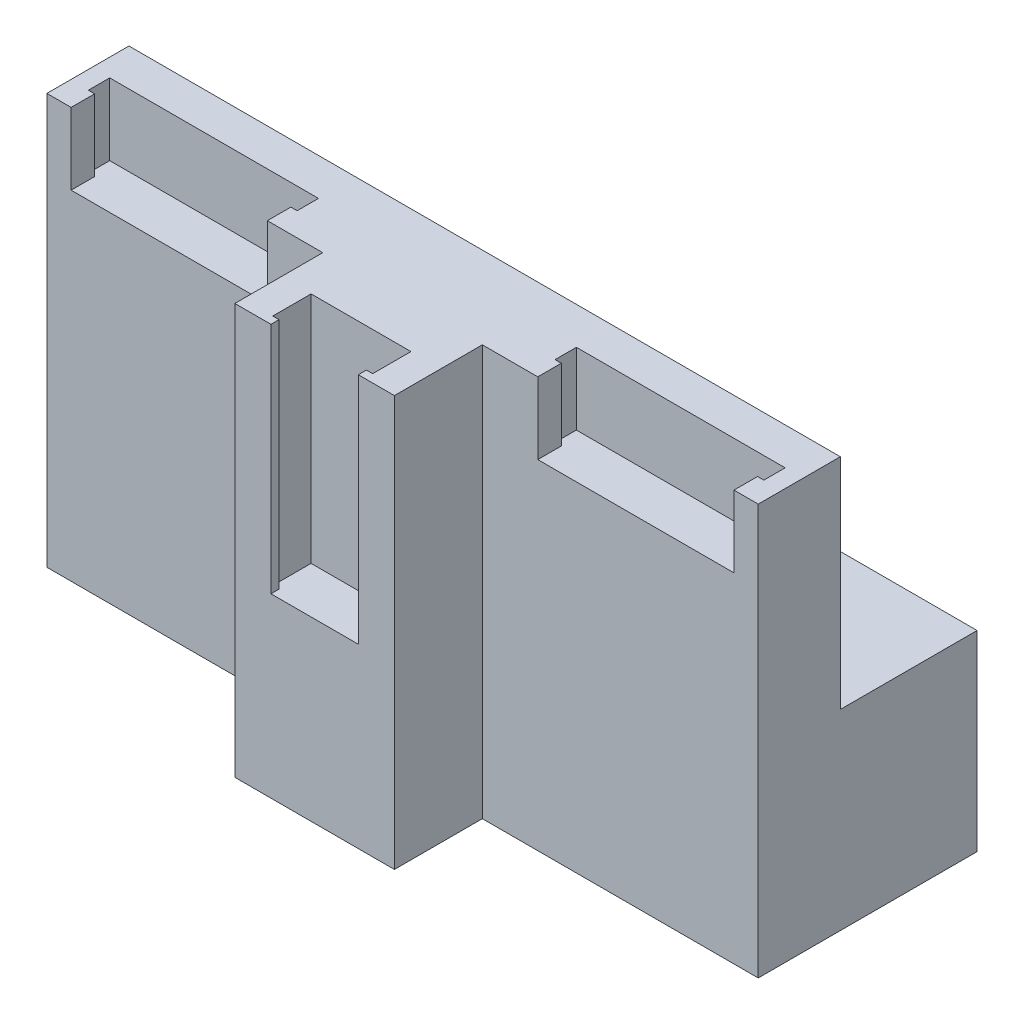
ISO-10303-21;
HEADER;
FILE_DESCRIPTION(('STEP AP214'),'2;1');
FILE_NAME('part.step','',(''),(''),'','','');
FILE_SCHEMA(('AUTOMOTIVE_DESIGN { 1 0 10303 214 1 1 1 1 }'));
ENDSEC;
DATA;
#1=APPLICATION_CONTEXT('core data for automotive mechanical design processes');
#2=APPLICATION_PROTOCOL_DEFINITION('international standard','automotive_design',2000,#1);
#3=PRODUCT_CONTEXT('',#1,'mechanical');
#4=PRODUCT('Part','Part','',(#3));
#5=PRODUCT_RELATED_PRODUCT_CATEGORY('part','',(#4));
#6=PRODUCT_DEFINITION_FORMATION('','',#4);
#7=PRODUCT_DEFINITION_CONTEXT('part definition',#1,'design');
#8=PRODUCT_DEFINITION('design','',#6,#7);
#9=PRODUCT_DEFINITION_SHAPE('','',#8);
#10=(LENGTH_UNIT() NAMED_UNIT(*) SI_UNIT(.MILLI.,.METRE.));
#11=(NAMED_UNIT(*) PLANE_ANGLE_UNIT() SI_UNIT($,.RADIAN.));
#12=(NAMED_UNIT(*) SI_UNIT($,.STERADIAN.) SOLID_ANGLE_UNIT());
#13=UNCERTAINTY_MEASURE_WITH_UNIT(LENGTH_MEASURE(1.E-05),#10,'distance_accuracy_value','');
#14=(GEOMETRIC_REPRESENTATION_CONTEXT(3) GLOBAL_UNCERTAINTY_ASSIGNED_CONTEXT((#13)) GLOBAL_UNIT_ASSIGNED_CONTEXT((#10,
#11,#12)) REPRESENTATION_CONTEXT('',''));
#15=CARTESIAN_POINT('',(0.,0.,0.));
#16=DIRECTION('',(0.,0.,1.));
#17=DIRECTION('',(1.,0.,0.));
#18=AXIS2_PLACEMENT_3D('',#15,#16,#17);
#19=CARTESIAN_POINT('',(60.5700000000001,0.,11.8));
#20=DIRECTION('',(-1.,0.,0.));
#21=DIRECTION('',(0.,0.,1.));
#22=AXIS2_PLACEMENT_3D('',#19,#20,#21);
#23=PLANE('',#22);
#24=DIRECTION('',(0.,1.,0.));
#25=VECTOR('',#24,1.);
#26=CARTESIAN_POINT('',(60.5700000000001,75.,15.7));
#27=LINE('',#26,#25);
#28=CARTESIAN_POINT('',(60.5700000000001,61.9,15.7));
#29=VERTEX_POINT('',#28);
#30=CARTESIAN_POINT('',(60.5700000000001,75.,15.7));
#31=VERTEX_POINT('',#30);
#32=EDGE_CURVE('E270',#29,#31,#27,.T.);
#33=ORIENTED_EDGE('',*,*,#32,.F.);
#34=DIRECTION('',(0.,0.,-1.));
#35=VECTOR('',#34,1.);
#36=CARTESIAN_POINT('',(60.5700000000001,61.9,15.7));
#37=LINE('',#36,#35);
#38=CARTESIAN_POINT('',(60.5700000000001,61.9,20.));
#39=VERTEX_POINT('',#38);
#40=EDGE_CURVE('E256',#39,#29,#37,.T.);
#41=ORIENTED_EDGE('',*,*,#40,.F.);
#42=DIRECTION('',(0.,-1.,0.));
#43=VECTOR('',#42,1.);
#44=CARTESIAN_POINT('',(60.5700000000001,0.,20.));
#45=LINE('',#44,#43);
#46=CARTESIAN_POINT('',(60.5700000000001,75.,20.));
#47=VERTEX_POINT('',#46);
#48=EDGE_CURVE('E268',#47,#39,#45,.T.);
#49=ORIENTED_EDGE('',*,*,#48,.F.);
#50=DIRECTION('',(0.,0.,1.));
#51=VECTOR('',#50,1.);
#52=CARTESIAN_POINT('',(60.5700000000001,75.,11.8));
#53=LINE('',#52,#51);
#54=EDGE_CURVE('E287',#31,#47,#53,.T.);
#55=ORIENTED_EDGE('',*,*,#54,.F.);
#56=EDGE_LOOP('',(#33,#41,#49,#55));
#57=FACE_BOUND('',#56,.T.);
#58=ADVANCED_FACE('F32',(#57),#23,.T.);
#59=CARTESIAN_POINT('',(24.7100000000001,0.,11.8));
#60=DIRECTION('',(-1.,0.,0.));
#61=DIRECTION('',(0.,-1.,0.));
#62=AXIS2_PLACEMENT_3D('',#59,#60,#61);
#63=PLANE('',#62);
#64=DIRECTION('',(0.,0.,1.));
#65=VECTOR('',#64,1.);
#66=CARTESIAN_POINT('',(24.7100000000001,61.9,20.));
#67=LINE('',#66,#65);
#68=CARTESIAN_POINT('',(24.7100000000001,61.9,15.7));
#69=VERTEX_POINT('',#68);
#70=CARTESIAN_POINT('',(24.7100000000001,61.9,20.));
#71=VERTEX_POINT('',#70);
#72=EDGE_CURVE('E258',#69,#71,#67,.T.);
#73=ORIENTED_EDGE('',*,*,#72,.F.);
#74=DIRECTION('',(0.,-1.,0.));
#75=VECTOR('',#74,1.);
#76=CARTESIAN_POINT('',(24.7100000000001,75.,15.7));
#77=LINE('',#76,#75);
#78=CARTESIAN_POINT('',(24.7100000000001,75.,15.7));
#79=VERTEX_POINT('',#78);
#80=EDGE_CURVE('E505',#79,#69,#77,.T.);
#81=ORIENTED_EDGE('',*,*,#80,.F.);
#82=DIRECTION('',(0.,0.,1.));
#83=VECTOR('',#82,1.);
#84=CARTESIAN_POINT('',(24.7100000000001,75.,11.8));
#85=LINE('',#84,#83);
#86=CARTESIAN_POINT('',(24.7100000000001,75.,20.));
#87=VERTEX_POINT('',#86);
#88=EDGE_CURVE('E284',#79,#87,#85,.T.);
#89=ORIENTED_EDGE('',*,*,#88,.T.);
#90=DIRECTION('',(0.,-1.,0.));
#91=VECTOR('',#90,1.);
#92=CARTESIAN_POINT('',(24.7100000000001,0.,20.));
#93=LINE('',#92,#91);
#94=EDGE_CURVE('E275',#87,#71,#93,.T.);
#95=ORIENTED_EDGE('',*,*,#94,.T.);
#96=EDGE_LOOP('',(#73,#81,#89,#95));
#97=FACE_BOUND('',#96,.T.);
#98=ADVANCED_FACE('F522',(#97),#63,.F.);
#99=CARTESIAN_POINT('',(0.,0.,11.8));
#100=DIRECTION('',(0.,0.,1.));
#101=DIRECTION('',(1.,0.,0.));
#102=AXIS2_PLACEMENT_3D('',#99,#100,#101);
#103=PLANE('',#102);
#104=DIRECTION('',(0.,1.,0.));
#105=VECTOR('',#104,1.);
#106=CARTESIAN_POINT('',(23.5650000000001,75.,11.8));
#107=LINE('',#106,#105);
#108=CARTESIAN_POINT('',(23.5650000000001,61.9,11.8));
#109=VERTEX_POINT('',#108);
#110=CARTESIAN_POINT('',(23.5650000000001,75.,11.8));
#111=VERTEX_POINT('',#110);
#112=EDGE_CURVE('E506',#109,#111,#107,.T.);
#113=ORIENTED_EDGE('',*,*,#112,.F.);
#114=DIRECTION('',(-1.,0.,0.));
#115=VECTOR('',#114,1.);
#116=CARTESIAN_POINT('',(23.5650000000001,61.9,11.8));
#117=LINE('',#116,#115);
#118=CARTESIAN_POINT('',(61.7150000000001,61.9,11.8));
#119=VERTEX_POINT('',#118);
#120=EDGE_CURVE('E988',#119,#109,#117,.T.);
#121=ORIENTED_EDGE('',*,*,#120,.F.);
#122=DIRECTION('',(0.,-1.,0.));
#123=VECTOR('',#122,1.);
#124=CARTESIAN_POINT('',(61.7150000000001,75.,11.8));
#125=LINE('',#124,#123);
#126=CARTESIAN_POINT('',(61.7150000000001,75.,11.8));
#127=VERTEX_POINT('',#126);
#128=EDGE_CURVE('E493',#127,#119,#125,.T.);
#129=ORIENTED_EDGE('',*,*,#128,.F.);
#130=DIRECTION('',(-1.,0.,0.));
#131=VECTOR('',#130,1.);
#132=CARTESIAN_POINT('',(0.,75.,11.8));
#133=LINE('',#132,#131);
#134=EDGE_CURVE('E278',#127,#111,#133,.T.);
#135=ORIENTED_EDGE('',*,*,#134,.T.);
#136=EDGE_LOOP('',(#113,#121,#129,#135));
#137=FACE_BOUND('',#136,.T.);
#138=ADVANCED_FACE('F592',(#137),#103,.T.);
#139=CARTESIAN_POINT('',(23.5650000000001,75.,15.7));
#140=DIRECTION('',(0.,0.,1.));
#141=DIRECTION('',(0.,-1.,0.));
#142=AXIS2_PLACEMENT_3D('',#139,#140,#141);
#143=PLANE('',#142);
#144=DIRECTION('',(1.,0.,0.));
#145=VECTOR('',#144,1.);
#146=CARTESIAN_POINT('',(24.7100000000001,61.9,15.7));
#147=LINE('',#146,#145);
#148=CARTESIAN_POINT('',(23.5650000000001,61.9,15.7));
#149=VERTEX_POINT('',#148);
#150=EDGE_CURVE('E518',#149,#69,#147,.T.);
#151=ORIENTED_EDGE('',*,*,#150,.F.);
#152=DIRECTION('',(0.,-1.,0.));
#153=VECTOR('',#152,1.);
#154=CARTESIAN_POINT('',(23.5650000000001,75.,15.7));
#155=LINE('',#154,#153);
#156=CARTESIAN_POINT('',(23.5650000000001,75.,15.7));
#157=VERTEX_POINT('',#156);
#158=EDGE_CURVE('E280',#157,#149,#155,.T.);
#159=ORIENTED_EDGE('',*,*,#158,.F.);
#160=DIRECTION('',(1.,0.,0.));
#161=VECTOR('',#160,1.);
#162=CARTESIAN_POINT('',(23.5650000000001,75.,15.7));
#163=LINE('',#162,#161);
#164=EDGE_CURVE('E276',#157,#79,#163,.T.);
#165=ORIENTED_EDGE('',*,*,#164,.T.);
#166=ORIENTED_EDGE('',*,*,#80,.T.);
#167=EDGE_LOOP('',(#151,#159,#165,#166));
#168=FACE_BOUND('',#167,.T.);
#169=ADVANCED_FACE('F517',(#168),#143,.F.);
#170=CARTESIAN_POINT('',(23.5650000000001,0.,0.));
#171=DIRECTION('',(-1.,0.,0.));
#172=DIRECTION('',(0.,-1.,0.));
#173=AXIS2_PLACEMENT_3D('',#170,#171,#172);
#174=PLANE('',#173);
#175=DIRECTION('',(0.,0.,1.));
#176=VECTOR('',#175,1.);
#177=CARTESIAN_POINT('',(23.5650000000001,61.9,15.7));
#178=LINE('',#177,#176);
#179=EDGE_CURVE('E986',#109,#149,#178,.T.);
#180=ORIENTED_EDGE('',*,*,#179,.F.);
#181=ORIENTED_EDGE('',*,*,#112,.T.);
#182=DIRECTION('',(0.,0.,1.));
#183=VECTOR('',#182,1.);
#184=CARTESIAN_POINT('',(23.5650000000001,75.,11.8));
#185=LINE('',#184,#183);
#186=EDGE_CURVE('E508',#111,#157,#185,.T.);
#187=ORIENTED_EDGE('',*,*,#186,.T.);
#188=ORIENTED_EDGE('',*,*,#158,.T.);
#189=EDGE_LOOP('',(#180,#181,#187,#188));
#190=FACE_BOUND('',#189,.T.);
#191=ADVANCED_FACE('F600',(#190),#174,.F.);
#192=CARTESIAN_POINT('',(61.7150000000001,75.,15.7));
#193=DIRECTION('',(0.,0.,1.));
#194=DIRECTION('',(0.,-1.,0.));
#195=AXIS2_PLACEMENT_3D('',#192,#193,#194);
#196=PLANE('',#195);
#197=DIRECTION('',(1.,0.,0.));
#198=VECTOR('',#197,1.);
#199=CARTESIAN_POINT('',(61.7150000000001,61.9,15.7));
#200=LINE('',#199,#198);
#201=CARTESIAN_POINT('',(61.7150000000001,61.9,15.7));
#202=VERTEX_POINT('',#201);
#203=EDGE_CURVE('E50',#29,#202,#200,.T.);
#204=ORIENTED_EDGE('',*,*,#203,.F.);
#205=ORIENTED_EDGE('',*,*,#32,.T.);
#206=DIRECTION('',(-1.,0.,0.));
#207=VECTOR('',#206,1.);
#208=CARTESIAN_POINT('',(61.7150000000001,75.,15.7));
#209=LINE('',#208,#207);
#210=CARTESIAN_POINT('',(61.7150000000001,75.,15.7));
#211=VERTEX_POINT('',#210);
#212=EDGE_CURVE('E501',#211,#31,#209,.T.);
#213=ORIENTED_EDGE('',*,*,#212,.F.);
#214=DIRECTION('',(0.,1.,0.));
#215=VECTOR('',#214,1.);
#216=CARTESIAN_POINT('',(61.7150000000001,75.,15.7));
#217=LINE('',#216,#215);
#218=EDGE_CURVE('E496',#202,#211,#217,.T.);
#219=ORIENTED_EDGE('',*,*,#218,.F.);
#220=EDGE_LOOP('',(#204,#205,#213,#219));
#221=FACE_BOUND('',#220,.T.);
#222=ADVANCED_FACE('F603',(#221),#196,.F.);
#223=CARTESIAN_POINT('',(61.7150000000001,0.,0.));
#224=DIRECTION('',(-1.,0.,0.));
#225=DIRECTION('',(0.,0.,1.));
#226=AXIS2_PLACEMENT_3D('',#223,#224,#225);
#227=PLANE('',#226);
#228=ORIENTED_EDGE('',*,*,#128,.T.);
#229=DIRECTION('',(0.,0.,-1.));
#230=VECTOR('',#229,1.);
#231=CARTESIAN_POINT('',(61.7150000000001,61.9,11.8));
#232=LINE('',#231,#230);
#233=EDGE_CURVE('E990',#202,#119,#232,.T.);
#234=ORIENTED_EDGE('',*,*,#233,.F.);
#235=ORIENTED_EDGE('',*,*,#218,.T.);
#236=DIRECTION('',(0.,0.,-1.));
#237=VECTOR('',#236,1.);
#238=CARTESIAN_POINT('',(61.7150000000001,75.,11.8));
#239=LINE('',#238,#237);
#240=EDGE_CURVE('E498',#211,#127,#239,.T.);
#241=ORIENTED_EDGE('',*,*,#240,.T.);
#242=EDGE_LOOP('',(#228,#234,#235,#241));
#243=FACE_BOUND('',#242,.T.);
#244=ADVANCED_FACE('F607',(#243),#227,.T.);
#245=CARTESIAN_POINT('',(-60.57,0.,11.8));
#246=DIRECTION('',(-1.,0.,0.));
#247=DIRECTION('',(0.,0.,1.));
#248=AXIS2_PLACEMENT_3D('',#245,#246,#247);
#249=PLANE('',#248);
#250=DIRECTION('',(0.,0.,1.));
#251=VECTOR('',#250,1.);
#252=CARTESIAN_POINT('',(-60.57,61.9,20.));
#253=LINE('',#252,#251);
#254=CARTESIAN_POINT('',(-60.57,61.9,15.7));
#255=VERTEX_POINT('',#254);
#256=CARTESIAN_POINT('',(-60.57,61.9,20.));
#257=VERTEX_POINT('',#256);
#258=EDGE_CURVE('E969',#255,#257,#253,.T.);
#259=ORIENTED_EDGE('',*,*,#258,.F.);
#260=DIRECTION('',(0.,-1.,0.));
#261=VECTOR('',#260,1.);
#262=CARTESIAN_POINT('',(-60.57,75.,15.7));
#263=LINE('',#262,#261);
#264=CARTESIAN_POINT('',(-60.57,75.,15.7));
#265=VERTEX_POINT('',#264);
#266=EDGE_CURVE('E470',#265,#255,#263,.T.);
#267=ORIENTED_EDGE('',*,*,#266,.F.);
#268=DIRECTION('',(0.,0.,1.));
#269=VECTOR('',#268,1.);
#270=CARTESIAN_POINT('',(-60.57,75.,11.8));
#271=LINE('',#270,#269);
#272=CARTESIAN_POINT('',(-60.57,75.,20.));
#273=VERTEX_POINT('',#272);
#274=EDGE_CURVE('E434',#265,#273,#271,.T.);
#275=ORIENTED_EDGE('',*,*,#274,.T.);
#276=DIRECTION('',(0.,-1.,0.));
#277=VECTOR('',#276,1.);
#278=CARTESIAN_POINT('',(-60.57,0.,20.));
#279=LINE('',#278,#277);
#280=EDGE_CURVE('E429',#273,#257,#279,.T.);
#281=ORIENTED_EDGE('',*,*,#280,.T.);
#282=EDGE_LOOP('',(#259,#267,#275,#281));
#283=FACE_BOUND('',#282,.T.);
#284=ADVANCED_FACE('F611',(#283),#249,.F.);
#285=CARTESIAN_POINT('',(-24.71,0.,11.8));
#286=DIRECTION('',(1.,0.,0.));
#287=DIRECTION('',(0.,1.,0.));
#288=AXIS2_PLACEMENT_3D('',#285,#286,#287);
#289=PLANE('',#288);
#290=DIRECTION('',(0.,0.,-1.));
#291=VECTOR('',#290,1.);
#292=CARTESIAN_POINT('',(-24.71,61.9,15.7));
#293=LINE('',#292,#291);
#294=CARTESIAN_POINT('',(-24.71,61.9,20.));
#295=VERTEX_POINT('',#294);
#296=CARTESIAN_POINT('',(-24.71,61.9,15.7));
#297=VERTEX_POINT('',#296);
#298=EDGE_CURVE('E980',#295,#297,#293,.T.);
#299=ORIENTED_EDGE('',*,*,#298,.F.);
#300=DIRECTION('',(0.,1.,0.));
#301=VECTOR('',#300,1.);
#302=CARTESIAN_POINT('',(-24.71,0.,20.));
#303=LINE('',#302,#301);
#304=CARTESIAN_POINT('',(-24.71,75.,20.));
#305=VERTEX_POINT('',#304);
#306=EDGE_CURVE('E483',#295,#305,#303,.T.);
#307=ORIENTED_EDGE('',*,*,#306,.T.);
#308=DIRECTION('',(0.,0.,1.));
#309=VECTOR('',#308,1.);
#310=CARTESIAN_POINT('',(-24.71,75.,11.8));
#311=LINE('',#310,#309);
#312=CARTESIAN_POINT('',(-24.71,75.,15.7));
#313=VERTEX_POINT('',#312);
#314=EDGE_CURVE('E487',#313,#305,#311,.T.);
#315=ORIENTED_EDGE('',*,*,#314,.F.);
#316=DIRECTION('',(0.,1.,0.));
#317=VECTOR('',#316,1.);
#318=CARTESIAN_POINT('',(-24.71,75.,15.7));
#319=LINE('',#318,#317);
#320=EDGE_CURVE('E457',#297,#313,#319,.T.);
#321=ORIENTED_EDGE('',*,*,#320,.F.);
#322=EDGE_LOOP('',(#299,#307,#315,#321));
#323=FACE_BOUND('',#322,.T.);
#324=ADVANCED_FACE('F613',(#323),#289,.F.);
#325=CARTESIAN_POINT('',(0.,0.,11.8));
#326=DIRECTION('',(0.,0.,1.));
#327=DIRECTION('',(1.,0.,0.));
#328=AXIS2_PLACEMENT_3D('',#325,#326,#327);
#329=PLANE('',#328);
#330=DIRECTION('',(0.,1.,0.));
#331=VECTOR('',#330,1.);
#332=CARTESIAN_POINT('',(-61.715,75.,11.8));
#333=LINE('',#332,#331);
#334=CARTESIAN_POINT('',(-61.715,61.9,11.8));
#335=VERTEX_POINT('',#334);
#336=CARTESIAN_POINT('',(-61.715,75.,11.8));
#337=VERTEX_POINT('',#336);
#338=EDGE_CURVE('E471',#335,#337,#333,.T.);
#339=ORIENTED_EDGE('',*,*,#338,.F.);
#340=DIRECTION('',(-1.,0.,0.));
#341=VECTOR('',#340,1.);
#342=CARTESIAN_POINT('',(-61.715,61.9,11.8));
#343=LINE('',#342,#341);
#344=CARTESIAN_POINT('',(-23.565,61.9,11.8));
#345=VERTEX_POINT('',#344);
#346=EDGE_CURVE('E975',#345,#335,#343,.T.);
#347=ORIENTED_EDGE('',*,*,#346,.F.);
#348=DIRECTION('',(0.,-1.,0.));
#349=VECTOR('',#348,1.);
#350=CARTESIAN_POINT('',(-23.565,75.,11.8));
#351=LINE('',#350,#349);
#352=CARTESIAN_POINT('',(-23.565,75.,11.8));
#353=VERTEX_POINT('',#352);
#354=EDGE_CURVE('E458',#353,#345,#351,.T.);
#355=ORIENTED_EDGE('',*,*,#354,.F.);
#356=DIRECTION('',(-1.,0.,0.));
#357=VECTOR('',#356,1.);
#358=CARTESIAN_POINT('',(0.,75.,11.8));
#359=LINE('',#358,#357);
#360=EDGE_CURVE('E484',#353,#337,#359,.T.);
#361=ORIENTED_EDGE('',*,*,#360,.T.);
#362=EDGE_LOOP('',(#339,#347,#355,#361));
#363=FACE_BOUND('',#362,.T.);
#364=ADVANCED_FACE('F616',(#363),#329,.T.);
#365=CARTESIAN_POINT('',(-61.715,75.,15.7));
#366=DIRECTION('',(0.,0.,1.));
#367=DIRECTION('',(0.,-1.,0.));
#368=AXIS2_PLACEMENT_3D('',#365,#366,#367);
#369=PLANE('',#368);
#370=DIRECTION('',(1.,0.,0.));
#371=VECTOR('',#370,1.);
#372=CARTESIAN_POINT('',(-60.57,61.9,15.7));
#373=LINE('',#372,#371);
#374=CARTESIAN_POINT('',(-61.715,61.9,15.7));
#375=VERTEX_POINT('',#374);
#376=EDGE_CURVE('E971',#375,#255,#373,.T.);
#377=ORIENTED_EDGE('',*,*,#376,.F.);
#378=DIRECTION('',(0.,-1.,0.));
#379=VECTOR('',#378,1.);
#380=CARTESIAN_POINT('',(-61.715,75.,15.7));
#381=LINE('',#380,#379);
#382=CARTESIAN_POINT('',(-61.715,75.,15.7));
#383=VERTEX_POINT('',#382);
#384=EDGE_CURVE('E476',#383,#375,#381,.T.);
#385=ORIENTED_EDGE('',*,*,#384,.F.);
#386=DIRECTION('',(1.,0.,0.));
#387=VECTOR('',#386,1.);
#388=CARTESIAN_POINT('',(-61.715,75.,15.7));
#389=LINE('',#388,#387);
#390=EDGE_CURVE('E479',#383,#265,#389,.T.);
#391=ORIENTED_EDGE('',*,*,#390,.T.);
#392=ORIENTED_EDGE('',*,*,#266,.T.);
#393=EDGE_LOOP('',(#377,#385,#391,#392));
#394=FACE_BOUND('',#393,.T.);
#395=ADVANCED_FACE('F623',(#394),#369,.F.);
#396=CARTESIAN_POINT('',(-61.715,0.,0.));
#397=DIRECTION('',(-1.,0.,0.));
#398=DIRECTION('',(0.,0.,1.));
#399=AXIS2_PLACEMENT_3D('',#396,#397,#398);
#400=PLANE('',#399);
#401=DIRECTION('',(0.,0.,1.));
#402=VECTOR('',#401,1.);
#403=CARTESIAN_POINT('',(-61.715,61.9,15.7));
#404=LINE('',#403,#402);
#405=EDGE_CURVE('E973',#335,#375,#404,.T.);
#406=ORIENTED_EDGE('',*,*,#405,.F.);
#407=ORIENTED_EDGE('',*,*,#338,.T.);
#408=DIRECTION('',(0.,0.,1.));
#409=VECTOR('',#408,1.);
#410=CARTESIAN_POINT('',(-61.715,75.,11.8));
#411=LINE('',#410,#409);
#412=EDGE_CURVE('E473',#337,#383,#411,.T.);
#413=ORIENTED_EDGE('',*,*,#412,.T.);
#414=ORIENTED_EDGE('',*,*,#384,.T.);
#415=EDGE_LOOP('',(#406,#407,#413,#414));
#416=FACE_BOUND('',#415,.T.);
#417=ADVANCED_FACE('F627',(#416),#400,.F.);
#418=CARTESIAN_POINT('',(-23.565,75.,15.7));
#419=DIRECTION('',(0.,0.,1.));
#420=DIRECTION('',(0.,-1.,0.));
#421=AXIS2_PLACEMENT_3D('',#418,#419,#420);
#422=PLANE('',#421);
#423=DIRECTION('',(1.,0.,0.));
#424=VECTOR('',#423,1.);
#425=CARTESIAN_POINT('',(-23.565,61.9,15.7));
#426=LINE('',#425,#424);
#427=CARTESIAN_POINT('',(-23.565,61.9,15.7));
#428=VERTEX_POINT('',#427);
#429=EDGE_CURVE('E58',#297,#428,#426,.T.);
#430=ORIENTED_EDGE('',*,*,#429,.F.);
#431=ORIENTED_EDGE('',*,*,#320,.T.);
#432=DIRECTION('',(-1.,0.,0.));
#433=VECTOR('',#432,1.);
#434=CARTESIAN_POINT('',(-23.565,75.,15.7));
#435=LINE('',#434,#433);
#436=CARTESIAN_POINT('',(-23.565,75.,15.7));
#437=VERTEX_POINT('',#436);
#438=EDGE_CURVE('E466',#437,#313,#435,.T.);
#439=ORIENTED_EDGE('',*,*,#438,.F.);
#440=DIRECTION('',(0.,1.,0.));
#441=VECTOR('',#440,1.);
#442=CARTESIAN_POINT('',(-23.565,75.,15.7));
#443=LINE('',#442,#441);
#444=EDGE_CURVE('E461',#428,#437,#443,.T.);
#445=ORIENTED_EDGE('',*,*,#444,.F.);
#446=EDGE_LOOP('',(#430,#431,#439,#445));
#447=FACE_BOUND('',#446,.T.);
#448=ADVANCED_FACE('F631',(#447),#422,.F.);
#449=CARTESIAN_POINT('',(-23.565,0.,0.));
#450=DIRECTION('',(-1.,0.,0.));
#451=DIRECTION('',(0.,-1.,0.));
#452=AXIS2_PLACEMENT_3D('',#449,#450,#451);
#453=PLANE('',#452);
#454=ORIENTED_EDGE('',*,*,#354,.T.);
#455=DIRECTION('',(0.,0.,-1.));
#456=VECTOR('',#455,1.);
#457=CARTESIAN_POINT('',(-23.565,61.9,11.8));
#458=LINE('',#457,#456);
#459=EDGE_CURVE('E977',#428,#345,#458,.T.);
#460=ORIENTED_EDGE('',*,*,#459,.F.);
#461=ORIENTED_EDGE('',*,*,#444,.T.);
#462=DIRECTION('',(0.,0.,-1.));
#463=VECTOR('',#462,1.);
#464=CARTESIAN_POINT('',(-23.565,75.,11.8));
#465=LINE('',#464,#463);
#466=EDGE_CURVE('E463',#437,#353,#465,.T.);
#467=ORIENTED_EDGE('',*,*,#466,.T.);
#468=EDGE_LOOP('',(#454,#460,#461,#467));
#469=FACE_BOUND('',#468,.T.);
#470=ADVANCED_FACE('F635',(#469),#453,.T.);
#471=CARTESIAN_POINT('',(-65.0000000000001,75.,20.));
#472=DIRECTION('',(0.,0.,-1.));
#473=DIRECTION('',(-1.,0.,0.));
#474=AXIS2_PLACEMENT_3D('',#471,#472,#473);
#475=PLANE('',#474);
#476=DIRECTION('',(1.,0.,0.));
#477=VECTOR('',#476,1.);
#478=CARTESIAN_POINT('',(-65.0000000000001,0.,20.));
#479=LINE('',#478,#477);
#480=CARTESIAN_POINT('',(-65.0000000000001,0.,20.));
#481=VERTEX_POINT('',#480);
#482=CARTESIAN_POINT('',(-14.58,0.,20.));
#483=VERTEX_POINT('',#482);
#484=EDGE_CURVE('E394',#481,#483,#479,.T.);
#485=ORIENTED_EDGE('',*,*,#484,.T.);
#486=DIRECTION('',(0.,-1.,0.));
#487=VECTOR('',#486,1.);
#488=CARTESIAN_POINT('',(-14.58,75.,20.));
#489=LINE('',#488,#487);
#490=CARTESIAN_POINT('',(-14.58,75.,20.));
#491=VERTEX_POINT('',#490);
#492=EDGE_CURVE('E342',#491,#483,#489,.T.);
#493=ORIENTED_EDGE('',*,*,#492,.F.);
#494=DIRECTION('',(1.,0.,0.));
#495=VECTOR('',#494,1.);
#496=CARTESIAN_POINT('',(-65.0000000000001,75.,20.));
#497=LINE('',#496,#495);
#498=EDGE_CURVE('E36',#305,#491,#497,.T.);
#499=ORIENTED_EDGE('',*,*,#498,.F.);
#500=ORIENTED_EDGE('',*,*,#306,.F.);
#501=DIRECTION('',(1.,0.,0.));
#502=VECTOR('',#501,1.);
#503=CARTESIAN_POINT('',(-24.71,61.9,20.));
#504=LINE('',#503,#502);
#505=EDGE_CURVE('E982',#257,#295,#504,.T.);
#506=ORIENTED_EDGE('',*,*,#505,.F.);
#507=ORIENTED_EDGE('',*,*,#280,.F.);
#508=CARTESIAN_POINT('',(-65.0000000000001,75.,20.));
#509=VERTEX_POINT('',#508);
#510=EDGE_CURVE('E384',#509,#273,#497,.T.);
#511=ORIENTED_EDGE('',*,*,#510,.F.);
#512=DIRECTION('',(0.,-1.,0.));
#513=VECTOR('',#512,1.);
#514=CARTESIAN_POINT('',(-65.0000000000001,75.,20.));
#515=LINE('',#514,#513);
#516=EDGE_CURVE('E389',#509,#481,#515,.T.);
#517=ORIENTED_EDGE('',*,*,#516,.T.);
#518=EDGE_LOOP('',(#485,#493,#499,#500,#506,#507,#511,#517));
#519=FACE_BOUND('',#518,.T.);
#520=ADVANCED_FACE('F424',(#519),#475,.F.);
#521=ORIENTED_EDGE('',*,*,#48,.T.);
#522=DIRECTION('',(1.,0.,0.));
#523=VECTOR('',#522,1.);
#524=CARTESIAN_POINT('',(60.5700000000001,61.9,20.));
#525=LINE('',#524,#523);
#526=EDGE_CURVE('E253',#71,#39,#525,.T.);
#527=ORIENTED_EDGE('',*,*,#526,.F.);
#528=ORIENTED_EDGE('',*,*,#94,.F.);
#529=CARTESIAN_POINT('',(14.58,75.,20.));
#530=VERTEX_POINT('',#529);
#531=EDGE_CURVE('E373',#530,#87,#497,.T.);
#532=ORIENTED_EDGE('',*,*,#531,.F.);
#533=DIRECTION('',(0.,1.,0.));
#534=VECTOR('',#533,1.);
#535=CARTESIAN_POINT('',(14.58,75.,20.));
#536=LINE('',#535,#534);
#537=CARTESIAN_POINT('',(14.58,0.,20.));
#538=VERTEX_POINT('',#537);
#539=EDGE_CURVE('E351',#538,#530,#536,.T.);
#540=ORIENTED_EDGE('',*,*,#539,.F.);
#541=CARTESIAN_POINT('',(65.,0.,20.));
#542=VERTEX_POINT('',#541);
#543=EDGE_CURVE('E397',#538,#542,#479,.T.);
#544=ORIENTED_EDGE('',*,*,#543,.T.);
#545=DIRECTION('',(0.,-1.,0.));
#546=VECTOR('',#545,1.);
#547=CARTESIAN_POINT('',(65.,75.,20.));
#548=LINE('',#547,#546);
#549=CARTESIAN_POINT('',(65.,75.,20.));
#550=VERTEX_POINT('',#549);
#551=EDGE_CURVE('E386',#550,#542,#548,.T.);
#552=ORIENTED_EDGE('',*,*,#551,.F.);
#553=EDGE_CURVE('E274',#47,#550,#497,.T.);
#554=ORIENTED_EDGE('',*,*,#553,.F.);
#555=EDGE_LOOP('',(#521,#527,#528,#532,#540,#544,#552,#554));
#556=FACE_BOUND('',#555,.T.);
#557=ADVANCED_FACE('F272',(#556),#475,.F.);
#558=CARTESIAN_POINT('',(0.,75.,0.));
#559=DIRECTION('',(0.,-1.,0.));
#560=DIRECTION('',(0.,0.,-1.));
#561=AXIS2_PLACEMENT_3D('',#558,#559,#560);
#562=PLANE('',#561);
#563=DIRECTION('',(1.,0.,0.));
#564=VECTOR('',#563,1.);
#565=CARTESIAN_POINT('',(65.,75.,5.));
#566=LINE('',#565,#564);
#567=CARTESIAN_POINT('',(-65.0000000000001,75.,5.));
#568=VERTEX_POINT('',#567);
#569=CARTESIAN_POINT('',(65.,75.,5.));
#570=VERTEX_POINT('',#569);
#571=EDGE_CURVE('E436',#568,#570,#566,.T.);
#572=ORIENTED_EDGE('',*,*,#571,.F.);
#573=DIRECTION('',(0.,0.,1.));
#574=VECTOR('',#573,1.);
#575=CARTESIAN_POINT('',(-65.0000000000001,75.,20.));
#576=LINE('',#575,#574);
#577=EDGE_CURVE('E374',#568,#509,#576,.T.);
#578=ORIENTED_EDGE('',*,*,#577,.T.);
#579=ORIENTED_EDGE('',*,*,#510,.T.);
#580=ORIENTED_EDGE('',*,*,#274,.F.);
#581=ORIENTED_EDGE('',*,*,#390,.F.);
#582=ORIENTED_EDGE('',*,*,#412,.F.);
#583=ORIENTED_EDGE('',*,*,#360,.F.);
#584=ORIENTED_EDGE('',*,*,#466,.F.);
#585=ORIENTED_EDGE('',*,*,#438,.T.);
#586=ORIENTED_EDGE('',*,*,#314,.T.);
#587=ORIENTED_EDGE('',*,*,#498,.T.);
#588=DIRECTION('',(0.,0.,-1.));
#589=VECTOR('',#588,1.);
#590=CARTESIAN_POINT('',(-14.58,75.,36.07));
#591=LINE('',#590,#589);
#592=CARTESIAN_POINT('',(-14.58,75.,36.07));
#593=VERTEX_POINT('',#592);
#594=EDGE_CURVE('E357',#593,#491,#591,.T.);
#595=ORIENTED_EDGE('',*,*,#594,.F.);
#596=DIRECTION('',(-1.,0.,0.));
#597=VECTOR('',#596,1.);
#598=CARTESIAN_POINT('',(-14.58,75.,36.07));
#599=LINE('',#598,#597);
#600=CARTESIAN_POINT('',(-7.98,75.,36.07));
#601=VERTEX_POINT('',#600);
#602=EDGE_CURVE('E353',#601,#593,#599,.T.);
#603=ORIENTED_EDGE('',*,*,#602,.F.);
#604=DIRECTION('',(0.,0.,1.));
#605=VECTOR('',#604,1.);
#606=CARTESIAN_POINT('',(-7.98,75.,27.59));
#607=LINE('',#606,#605);
#608=CARTESIAN_POINT('',(-7.98,75.,34.59));
#609=VERTEX_POINT('',#608);
#610=EDGE_CURVE('E343',#609,#601,#607,.T.);
#611=ORIENTED_EDGE('',*,*,#610,.F.);
#612=DIRECTION('',(1.,0.,0.));
#613=VECTOR('',#612,1.);
#614=CARTESIAN_POINT('',(-9.125,75.,34.59));
#615=LINE('',#614,#613);
#616=CARTESIAN_POINT('',(-9.125,75.,34.59));
#617=VERTEX_POINT('',#616);
#618=EDGE_CURVE('E320',#617,#609,#615,.T.);
#619=ORIENTED_EDGE('',*,*,#618,.F.);
#620=DIRECTION('',(0.,0.,1.));
#621=VECTOR('',#620,1.);
#622=CARTESIAN_POINT('',(-9.125,75.,27.59));
#623=LINE('',#622,#621);
#624=CARTESIAN_POINT('',(-9.125,75.,27.59));
#625=VERTEX_POINT('',#624);
#626=EDGE_CURVE('E311',#625,#617,#623,.T.);
#627=ORIENTED_EDGE('',*,*,#626,.F.);
#628=DIRECTION('',(-1.,0.,0.));
#629=VECTOR('',#628,1.);
#630=CARTESIAN_POINT('',(0.,75.,27.59));
#631=LINE('',#630,#629);
#632=CARTESIAN_POINT('',(9.125,75.,27.59));
#633=VERTEX_POINT('',#632);
#634=EDGE_CURVE('E329',#633,#625,#631,.T.);
#635=ORIENTED_EDGE('',*,*,#634,.F.);
#636=DIRECTION('',(0.,0.,-1.));
#637=VECTOR('',#636,1.);
#638=CARTESIAN_POINT('',(9.125,75.,27.59));
#639=LINE('',#638,#637);
#640=CARTESIAN_POINT('',(9.125,75.,34.59));
#641=VERTEX_POINT('',#640);
#642=EDGE_CURVE('E298',#641,#633,#639,.T.);
#643=ORIENTED_EDGE('',*,*,#642,.F.);
#644=DIRECTION('',(-1.,0.,0.));
#645=VECTOR('',#644,1.);
#646=CARTESIAN_POINT('',(9.125,75.,34.59));
#647=LINE('',#646,#645);
#648=CARTESIAN_POINT('',(7.98,75.,34.59));
#649=VERTEX_POINT('',#648);
#650=EDGE_CURVE('E303',#641,#649,#647,.T.);
#651=ORIENTED_EDGE('',*,*,#650,.T.);
#652=DIRECTION('',(0.,0.,1.));
#653=VECTOR('',#652,1.);
#654=CARTESIAN_POINT('',(7.97999999999999,75.,27.59));
#655=LINE('',#654,#653);
#656=CARTESIAN_POINT('',(7.97999999999999,75.,36.07));
#657=VERTEX_POINT('',#656);
#658=EDGE_CURVE('E345',#649,#657,#655,.T.);
#659=ORIENTED_EDGE('',*,*,#658,.T.);
#660=CARTESIAN_POINT('',(14.58,75.,36.07));
#661=VERTEX_POINT('',#660);
#662=EDGE_CURVE('E354',#661,#657,#599,.T.);
#663=ORIENTED_EDGE('',*,*,#662,.F.);
#664=DIRECTION('',(0.,0.,-1.));
#665=VECTOR('',#664,1.);
#666=CARTESIAN_POINT('',(14.58,75.,36.07));
#667=LINE('',#666,#665);
#668=EDGE_CURVE('E368',#661,#530,#667,.T.);
#669=ORIENTED_EDGE('',*,*,#668,.T.);
#670=ORIENTED_EDGE('',*,*,#531,.T.);
#671=ORIENTED_EDGE('',*,*,#88,.F.);
#672=ORIENTED_EDGE('',*,*,#164,.F.);
#673=ORIENTED_EDGE('',*,*,#186,.F.);
#674=ORIENTED_EDGE('',*,*,#134,.F.);
#675=ORIENTED_EDGE('',*,*,#240,.F.);
#676=ORIENTED_EDGE('',*,*,#212,.T.);
#677=ORIENTED_EDGE('',*,*,#54,.T.);
#678=ORIENTED_EDGE('',*,*,#553,.T.);
#679=DIRECTION('',(0.,0.,-1.));
#680=VECTOR('',#679,1.);
#681=CARTESIAN_POINT('',(65.,75.,20.));
#682=LINE('',#681,#680);
#683=EDGE_CURVE('E360',#550,#570,#682,.T.);
#684=ORIENTED_EDGE('',*,*,#683,.T.);
#685=EDGE_LOOP('',(#572,#578,#579,#580,#581,#582,#583,#584,#585,#586,#587,#595,#603,#611,#619,
#627,#635,#643,#651,#659,#663,#669,#670,#671,#672,#673,#674,#675,#676,#677,#678,#684));
#686=FACE_BOUND('',#685,.T.);
#687=ADVANCED_FACE('F432',(#686),#562,.F.);
#688=CARTESIAN_POINT('',(0.,0.,36.07));
#689=DIRECTION('',(0.,0.,1.));
#690=DIRECTION('',(1.,0.,0.));
#691=AXIS2_PLACEMENT_3D('',#688,#689,#690);
#692=PLANE('',#691);
#693=DIRECTION('',(1.,0.,0.));
#694=VECTOR('',#693,1.);
#695=CARTESIAN_POINT('',(0.,32.35,36.07));
#696=LINE('',#695,#694);
#697=CARTESIAN_POINT('',(-7.98,32.35,36.07));
#698=VERTEX_POINT('',#697);
#699=CARTESIAN_POINT('',(7.97999999999999,32.35,36.07));
#700=VERTEX_POINT('',#699);
#701=EDGE_CURVE('E325',#698,#700,#696,.T.);
#702=ORIENTED_EDGE('',*,*,#701,.F.);
#703=DIRECTION('',(0.,1.,0.));
#704=VECTOR('',#703,1.);
#705=CARTESIAN_POINT('',(-7.98,0.,36.07));
#706=LINE('',#705,#704);
#707=EDGE_CURVE('E330',#698,#601,#706,.T.);
#708=ORIENTED_EDGE('',*,*,#707,.T.);
#709=ORIENTED_EDGE('',*,*,#602,.T.);
#710=DIRECTION('',(0.,-1.,0.));
#711=VECTOR('',#710,1.);
#712=CARTESIAN_POINT('',(-14.58,75.,36.07));
#713=LINE('',#712,#711);
#714=CARTESIAN_POINT('',(-14.58,0.,36.07));
#715=VERTEX_POINT('',#714);
#716=EDGE_CURVE('E348',#593,#715,#713,.T.);
#717=ORIENTED_EDGE('',*,*,#716,.T.);
#718=DIRECTION('',(-1.,0.,0.));
#719=VECTOR('',#718,1.);
#720=CARTESIAN_POINT('',(-14.58,0.,36.07));
#721=LINE('',#720,#719);
#722=CARTESIAN_POINT('',(14.58,0.,36.07));
#723=VERTEX_POINT('',#722);
#724=EDGE_CURVE('E454',#723,#715,#721,.T.);
#725=ORIENTED_EDGE('',*,*,#724,.F.);
#726=DIRECTION('',(0.,1.,0.));
#727=VECTOR('',#726,1.);
#728=CARTESIAN_POINT('',(14.58,75.,36.07));
#729=LINE('',#728,#727);
#730=EDGE_CURVE('E350',#723,#661,#729,.T.);
#731=ORIENTED_EDGE('',*,*,#730,.T.);
#732=ORIENTED_EDGE('',*,*,#662,.T.);
#733=DIRECTION('',(0.,1.,0.));
#734=VECTOR('',#733,1.);
#735=CARTESIAN_POINT('',(7.98,0.,36.07));
#736=LINE('',#735,#734);
#737=EDGE_CURVE('E335',#700,#657,#736,.T.);
#738=ORIENTED_EDGE('',*,*,#737,.F.);
#739=EDGE_LOOP('',(#702,#708,#709,#717,#725,#731,#732,#738));
#740=FACE_BOUND('',#739,.T.);
#741=ADVANCED_FACE('F542',(#740),#692,.T.);
#742=CARTESIAN_POINT('',(65.,75.,20.));
#743=DIRECTION('',(-1.,0.,0.));
#744=DIRECTION('',(0.,0.,1.));
#745=AXIS2_PLACEMENT_3D('',#742,#743,#744);
#746=PLANE('',#745);
#747=DIRECTION('',(0.,0.,-1.));
#748=VECTOR('',#747,1.);
#749=CARTESIAN_POINT('',(65.,35.,-20.));
#750=LINE('',#749,#748);
#751=CARTESIAN_POINT('',(65.,35.,5.));
#752=VERTEX_POINT('',#751);
#753=CARTESIAN_POINT('',(65.,35.,-20.));
#754=VERTEX_POINT('',#753);
#755=EDGE_CURVE('E441',#752,#754,#750,.T.);
#756=ORIENTED_EDGE('',*,*,#755,.F.);
#757=DIRECTION('',(0.,1.,0.));
#758=VECTOR('',#757,1.);
#759=CARTESIAN_POINT('',(65.,35.,5.));
#760=LINE('',#759,#758);
#761=EDGE_CURVE('E440',#752,#570,#760,.T.);
#762=ORIENTED_EDGE('',*,*,#761,.T.);
#763=ORIENTED_EDGE('',*,*,#683,.F.);
#764=ORIENTED_EDGE('',*,*,#551,.T.);
#765=DIRECTION('',(0.,0.,-1.));
#766=VECTOR('',#765,1.);
#767=CARTESIAN_POINT('',(65.,0.,20.));
#768=LINE('',#767,#766);
#769=CARTESIAN_POINT('',(65.,0.,-20.));
#770=VERTEX_POINT('',#769);
#771=EDGE_CURVE('E371',#542,#770,#768,.T.);
#772=ORIENTED_EDGE('',*,*,#771,.T.);
#773=DIRECTION('',(0.,-1.,0.));
#774=VECTOR('',#773,1.);
#775=CARTESIAN_POINT('',(65.,75.,-20.));
#776=LINE('',#775,#774);
#777=EDGE_CURVE('E11',#754,#770,#776,.T.);
#778=ORIENTED_EDGE('',*,*,#777,.F.);
#779=EDGE_LOOP('',(#756,#762,#763,#764,#772,#778));
#780=FACE_BOUND('',#779,.T.);
#781=ADVANCED_FACE('F34',(#780),#746,.F.);
#782=CARTESIAN_POINT('',(-65.0000000000001,75.,-20.));
#783=DIRECTION('',(0.,0.,1.));
#784=DIRECTION('',(1.,0.,0.));
#785=AXIS2_PLACEMENT_3D('',#782,#783,#784);
#786=PLANE('',#785);
#787=DIRECTION('',(0.,-1.,0.));
#788=VECTOR('',#787,1.);
#789=CARTESIAN_POINT('',(-65.0000000000001,75.,-20.));
#790=LINE('',#789,#788);
#791=CARTESIAN_POINT('',(-65.0000000000001,35.,-20.));
#792=VERTEX_POINT('',#791);
#793=CARTESIAN_POINT('',(-65.0000000000001,0.,-20.));
#794=VERTEX_POINT('',#793);
#795=EDGE_CURVE('E42',#792,#794,#790,.T.);
#796=ORIENTED_EDGE('',*,*,#795,.F.);
#797=DIRECTION('',(-1.,0.,0.));
#798=VECTOR('',#797,1.);
#799=CARTESIAN_POINT('',(65.,35.,-20.));
#800=LINE('',#799,#798);
#801=EDGE_CURVE('E449',#754,#792,#800,.T.);
#802=ORIENTED_EDGE('',*,*,#801,.F.);
#803=ORIENTED_EDGE('',*,*,#777,.T.);
#804=DIRECTION('',(-1.,0.,0.));
#805=VECTOR('',#804,1.);
#806=CARTESIAN_POINT('',(-65.0000000000001,0.,-20.));
#807=LINE('',#806,#805);
#808=EDGE_CURVE('E399',#770,#794,#807,.T.);
#809=ORIENTED_EDGE('',*,*,#808,.T.);
#810=EDGE_LOOP('',(#796,#802,#803,#809));
#811=FACE_BOUND('',#810,.T.);
#812=ADVANCED_FACE('F726',(#811),#786,.F.);
#813=CARTESIAN_POINT('',(-65.0000000000001,75.,20.));
#814=DIRECTION('',(1.,0.,0.));
#815=DIRECTION('',(0.,0.,-1.));
#816=AXIS2_PLACEMENT_3D('',#813,#814,#815);
#817=PLANE('',#816);
#818=ORIENTED_EDGE('',*,*,#577,.F.);
#819=DIRECTION('',(0.,1.,0.));
#820=VECTOR('',#819,1.);
#821=CARTESIAN_POINT('',(-65.0000000000001,35.,5.));
#822=LINE('',#821,#820);
#823=CARTESIAN_POINT('',(-65.0000000000001,35.,5.));
#824=VERTEX_POINT('',#823);
#825=EDGE_CURVE('E965',#824,#568,#822,.T.);
#826=ORIENTED_EDGE('',*,*,#825,.F.);
#827=DIRECTION('',(0.,0.,1.));
#828=VECTOR('',#827,1.);
#829=CARTESIAN_POINT('',(-65.0000000000001,35.,-20.));
#830=LINE('',#829,#828);
#831=EDGE_CURVE('E967',#792,#824,#830,.T.);
#832=ORIENTED_EDGE('',*,*,#831,.F.);
#833=ORIENTED_EDGE('',*,*,#795,.T.);
#834=DIRECTION('',(0.,0.,1.));
#835=VECTOR('',#834,1.);
#836=CARTESIAN_POINT('',(-65.0000000000001,0.,20.));
#837=LINE('',#836,#835);
#838=EDGE_CURVE('E398',#794,#481,#837,.T.);
#839=ORIENTED_EDGE('',*,*,#838,.T.);
#840=ORIENTED_EDGE('',*,*,#516,.F.);
#841=EDGE_LOOP('',(#818,#826,#832,#833,#839,#840));
#842=FACE_BOUND('',#841,.T.);
#843=ADVANCED_FACE('F420',(#842),#817,.F.);
#844=CARTESIAN_POINT('',(0.,0.,0.));
#845=DIRECTION('',(0.,-1.,0.));
#846=DIRECTION('',(0.,0.,-1.));
#847=AXIS2_PLACEMENT_3D('',#844,#845,#846);
#848=PLANE('',#847);
#849=ORIENTED_EDGE('',*,*,#771,.F.);
#850=ORIENTED_EDGE('',*,*,#543,.F.);
#851=DIRECTION('',(0.,0.,1.));
#852=VECTOR('',#851,1.);
#853=CARTESIAN_POINT('',(14.58,0.,36.07));
#854=LINE('',#853,#852);
#855=EDGE_CURVE('E447',#538,#723,#854,.T.);
#856=ORIENTED_EDGE('',*,*,#855,.T.);
#857=ORIENTED_EDGE('',*,*,#724,.T.);
#858=DIRECTION('',(0.,0.,-1.));
#859=VECTOR('',#858,1.);
#860=CARTESIAN_POINT('',(-14.58,0.,36.07));
#861=LINE('',#860,#859);
#862=EDGE_CURVE('E444',#715,#483,#861,.T.);
#863=ORIENTED_EDGE('',*,*,#862,.T.);
#864=ORIENTED_EDGE('',*,*,#484,.F.);
#865=ORIENTED_EDGE('',*,*,#838,.F.);
#866=ORIENTED_EDGE('',*,*,#808,.F.);
#867=EDGE_LOOP('',(#849,#850,#856,#857,#863,#864,#865,#866));
#868=FACE_BOUND('',#867,.T.);
#869=ADVANCED_FACE('F413',(#868),#848,.T.);
#870=CARTESIAN_POINT('',(-14.58,75.,36.07));
#871=DIRECTION('',(1.,0.,0.));
#872=DIRECTION('',(0.,0.,-1.));
#873=AXIS2_PLACEMENT_3D('',#870,#871,#872);
#874=PLANE('',#873);
#875=ORIENTED_EDGE('',*,*,#492,.T.);
#876=ORIENTED_EDGE('',*,*,#862,.F.);
#877=ORIENTED_EDGE('',*,*,#716,.F.);
#878=ORIENTED_EDGE('',*,*,#594,.T.);
#879=EDGE_LOOP('',(#875,#876,#877,#878));
#880=FACE_BOUND('',#879,.T.);
#881=ADVANCED_FACE('F536',(#880),#874,.F.);
#882=CARTESIAN_POINT('',(14.58,75.,36.07));
#883=DIRECTION('',(-1.,0.,0.));
#884=DIRECTION('',(0.,-1.,0.));
#885=AXIS2_PLACEMENT_3D('',#882,#883,#884);
#886=PLANE('',#885);
#887=ORIENTED_EDGE('',*,*,#539,.T.);
#888=ORIENTED_EDGE('',*,*,#668,.F.);
#889=ORIENTED_EDGE('',*,*,#730,.F.);
#890=ORIENTED_EDGE('',*,*,#855,.F.);
#891=EDGE_LOOP('',(#887,#888,#889,#890));
#892=FACE_BOUND('',#891,.T.);
#893=ADVANCED_FACE('F545',(#892),#886,.F.);
#894=CARTESIAN_POINT('',(0.,32.35,27.59));
#895=DIRECTION('',(0.,-1.,0.));
#896=DIRECTION('',(0.,0.,-1.));
#897=AXIS2_PLACEMENT_3D('',#894,#895,#896);
#898=PLANE('',#897);
#899=ORIENTED_EDGE('',*,*,#701,.T.);
#900=DIRECTION('',(0.,0.,1.));
#901=VECTOR('',#900,1.);
#902=CARTESIAN_POINT('',(7.97999999999999,32.35,27.59));
#903=LINE('',#902,#901);
#904=CARTESIAN_POINT('',(7.98,32.35,34.59));
#905=VERTEX_POINT('',#904);
#906=EDGE_CURVE('E332',#905,#700,#903,.T.);
#907=ORIENTED_EDGE('',*,*,#906,.F.);
#908=DIRECTION('',(-1.,0.,0.));
#909=VECTOR('',#908,1.);
#910=CARTESIAN_POINT('',(9.125,32.35,34.59));
#911=LINE('',#910,#909);
#912=CARTESIAN_POINT('',(9.125,32.35,34.59));
#913=VERTEX_POINT('',#912);
#914=EDGE_CURVE('E301',#913,#905,#911,.T.);
#915=ORIENTED_EDGE('',*,*,#914,.F.);
#916=DIRECTION('',(0.,0.,1.));
#917=VECTOR('',#916,1.);
#918=CARTESIAN_POINT('',(9.125,32.35,27.59));
#919=LINE('',#918,#917);
#920=CARTESIAN_POINT('',(9.125,32.35,27.59));
#921=VERTEX_POINT('',#920);
#922=EDGE_CURVE('E292',#921,#913,#919,.T.);
#923=ORIENTED_EDGE('',*,*,#922,.F.);
#924=DIRECTION('',(1.,0.,0.));
#925=VECTOR('',#924,1.);
#926=CARTESIAN_POINT('',(0.,32.35,27.59));
#927=LINE('',#926,#925);
#928=CARTESIAN_POINT('',(-9.125,32.35,27.59));
#929=VERTEX_POINT('',#928);
#930=EDGE_CURVE('E327',#929,#921,#927,.T.);
#931=ORIENTED_EDGE('',*,*,#930,.F.);
#932=DIRECTION('',(0.,0.,-1.));
#933=VECTOR('',#932,1.);
#934=CARTESIAN_POINT('',(-9.125,32.35,27.59));
#935=LINE('',#934,#933);
#936=CARTESIAN_POINT('',(-9.125,32.35,34.59));
#937=VERTEX_POINT('',#936);
#938=EDGE_CURVE('E317',#937,#929,#935,.T.);
#939=ORIENTED_EDGE('',*,*,#938,.F.);
#940=DIRECTION('',(1.,0.,0.));
#941=VECTOR('',#940,1.);
#942=CARTESIAN_POINT('',(-9.125,32.35,34.59));
#943=LINE('',#942,#941);
#944=CARTESIAN_POINT('',(-7.98,32.35,34.59));
#945=VERTEX_POINT('',#944);
#946=EDGE_CURVE('E323',#937,#945,#943,.T.);
#947=ORIENTED_EDGE('',*,*,#946,.T.);
#948=DIRECTION('',(0.,0.,1.));
#949=VECTOR('',#948,1.);
#950=CARTESIAN_POINT('',(-7.98,32.35,27.59));
#951=LINE('',#950,#949);
#952=EDGE_CURVE('E340',#945,#698,#951,.T.);
#953=ORIENTED_EDGE('',*,*,#952,.T.);
#954=EDGE_LOOP('',(#899,#907,#915,#923,#931,#939,#947,#953));
#955=FACE_BOUND('',#954,.T.);
#956=ADVANCED_FACE('F554',(#955),#898,.F.);
#957=CARTESIAN_POINT('',(-7.98,0.,27.59));
#958=DIRECTION('',(1.,0.,0.));
#959=DIRECTION('',(0.,1.,0.));
#960=AXIS2_PLACEMENT_3D('',#957,#958,#959);
#961=PLANE('',#960);
#962=DIRECTION('',(0.,-1.,0.));
#963=VECTOR('',#962,1.);
#964=CARTESIAN_POINT('',(-7.98,75.,34.59));
#965=LINE('',#964,#963);
#966=EDGE_CURVE('E306',#609,#945,#965,.T.);
#967=ORIENTED_EDGE('',*,*,#966,.F.);
#968=ORIENTED_EDGE('',*,*,#610,.T.);
#969=ORIENTED_EDGE('',*,*,#707,.F.);
#970=ORIENTED_EDGE('',*,*,#952,.F.);
#971=EDGE_LOOP('',(#967,#968,#969,#970));
#972=FACE_BOUND('',#971,.T.);
#973=ADVANCED_FACE('F562',(#972),#961,.T.);
#974=CARTESIAN_POINT('',(7.98,0.,27.59));
#975=DIRECTION('',(1.,0.,0.));
#976=DIRECTION('',(0.,1.,0.));
#977=AXIS2_PLACEMENT_3D('',#974,#975,#976);
#978=PLANE('',#977);
#979=ORIENTED_EDGE('',*,*,#658,.F.);
#980=DIRECTION('',(0.,1.,0.));
#981=VECTOR('',#980,1.);
#982=CARTESIAN_POINT('',(7.98,75.,34.59));
#983=LINE('',#982,#981);
#984=EDGE_CURVE('E286',#905,#649,#983,.T.);
#985=ORIENTED_EDGE('',*,*,#984,.F.);
#986=ORIENTED_EDGE('',*,*,#906,.T.);
#987=ORIENTED_EDGE('',*,*,#737,.T.);
#988=EDGE_LOOP('',(#979,#985,#986,#987));
#989=FACE_BOUND('',#988,.T.);
#990=ADVANCED_FACE('F551',(#989),#978,.F.);
#991=CARTESIAN_POINT('',(0.,0.,27.59));
#992=DIRECTION('',(0.,0.,1.));
#993=DIRECTION('',(1.,0.,0.));
#994=AXIS2_PLACEMENT_3D('',#991,#992,#993);
#995=PLANE('',#994);
#996=ORIENTED_EDGE('',*,*,#930,.T.);
#997=DIRECTION('',(0.,-1.,0.));
#998=VECTOR('',#997,1.);
#999=CARTESIAN_POINT('',(9.125,75.,27.59));
#1000=LINE('',#999,#998);
#1001=EDGE_CURVE('E289',#633,#921,#1000,.T.);
#1002=ORIENTED_EDGE('',*,*,#1001,.F.);
#1003=ORIENTED_EDGE('',*,*,#634,.T.);
#1004=DIRECTION('',(0.,1.,0.));
#1005=VECTOR('',#1004,1.);
#1006=CARTESIAN_POINT('',(-9.125,75.,27.59));
#1007=LINE('',#1006,#1005);
#1008=EDGE_CURVE('E308',#929,#625,#1007,.T.);
#1009=ORIENTED_EDGE('',*,*,#1008,.F.);
#1010=EDGE_LOOP('',(#996,#1002,#1003,#1009));
#1011=FACE_BOUND('',#1010,.T.);
#1012=ADVANCED_FACE('F571',(#1011),#995,.T.);
#1013=CARTESIAN_POINT('',(-9.125,75.,34.59));
#1014=DIRECTION('',(0.,0.,1.));
#1015=DIRECTION('',(0.,-1.,0.));
#1016=AXIS2_PLACEMENT_3D('',#1013,#1014,#1015);
#1017=PLANE('',#1016);
#1018=ORIENTED_EDGE('',*,*,#966,.T.);
#1019=ORIENTED_EDGE('',*,*,#946,.F.);
#1020=DIRECTION('',(0.,-1.,0.));
#1021=VECTOR('',#1020,1.);
#1022=CARTESIAN_POINT('',(-9.125,75.,34.59));
#1023=LINE('',#1022,#1021);
#1024=EDGE_CURVE('E314',#617,#937,#1023,.T.);
#1025=ORIENTED_EDGE('',*,*,#1024,.F.);
#1026=ORIENTED_EDGE('',*,*,#618,.T.);
#1027=EDGE_LOOP('',(#1018,#1019,#1025,#1026));
#1028=FACE_BOUND('',#1027,.T.);
#1029=ADVANCED_FACE('F564',(#1028),#1017,.F.);
#1030=CARTESIAN_POINT('',(-9.125,0.,0.));
#1031=DIRECTION('',(-1.,0.,0.));
#1032=DIRECTION('',(0.,0.,1.));
#1033=AXIS2_PLACEMENT_3D('',#1030,#1031,#1032);
#1034=PLANE('',#1033);
#1035=ORIENTED_EDGE('',*,*,#1008,.T.);
#1036=ORIENTED_EDGE('',*,*,#626,.T.);
#1037=ORIENTED_EDGE('',*,*,#1024,.T.);
#1038=ORIENTED_EDGE('',*,*,#938,.T.);
#1039=EDGE_LOOP('',(#1035,#1036,#1037,#1038));
#1040=FACE_BOUND('',#1039,.T.);
#1041=ADVANCED_FACE('F567',(#1040),#1034,.F.);
#1042=CARTESIAN_POINT('',(9.125,75.,34.59));
#1043=DIRECTION('',(0.,0.,1.));
#1044=DIRECTION('',(0.,-1.,0.));
#1045=AXIS2_PLACEMENT_3D('',#1042,#1043,#1044);
#1046=PLANE('',#1045);
#1047=ORIENTED_EDGE('',*,*,#984,.T.);
#1048=ORIENTED_EDGE('',*,*,#650,.F.);
#1049=DIRECTION('',(0.,1.,0.));
#1050=VECTOR('',#1049,1.);
#1051=CARTESIAN_POINT('',(9.125,75.,34.59));
#1052=LINE('',#1051,#1050);
#1053=EDGE_CURVE('E295',#913,#641,#1052,.T.);
#1054=ORIENTED_EDGE('',*,*,#1053,.F.);
#1055=ORIENTED_EDGE('',*,*,#914,.T.);
#1056=EDGE_LOOP('',(#1047,#1048,#1054,#1055));
#1057=FACE_BOUND('',#1056,.T.);
#1058=ADVANCED_FACE('F577',(#1057),#1046,.F.);
#1059=CARTESIAN_POINT('',(9.125,0.,0.));
#1060=DIRECTION('',(-1.,0.,0.));
#1061=DIRECTION('',(0.,-1.,0.));
#1062=AXIS2_PLACEMENT_3D('',#1059,#1060,#1061);
#1063=PLANE('',#1062);
#1064=ORIENTED_EDGE('',*,*,#1001,.T.);
#1065=ORIENTED_EDGE('',*,*,#922,.T.);
#1066=ORIENTED_EDGE('',*,*,#1053,.T.);
#1067=ORIENTED_EDGE('',*,*,#642,.T.);
#1068=EDGE_LOOP('',(#1064,#1065,#1066,#1067));
#1069=FACE_BOUND('',#1068,.T.);
#1070=ADVANCED_FACE('F574',(#1069),#1063,.T.);
#1071=CARTESIAN_POINT('',(65.,35.,5.));
#1072=DIRECTION('',(0.,0.,1.));
#1073=DIRECTION('',(1.,0.,0.));
#1074=AXIS2_PLACEMENT_3D('',#1071,#1072,#1073);
#1075=PLANE('',#1074);
#1076=ORIENTED_EDGE('',*,*,#571,.T.);
#1077=ORIENTED_EDGE('',*,*,#761,.F.);
#1078=DIRECTION('',(1.,0.,0.));
#1079=VECTOR('',#1078,1.);
#1080=CARTESIAN_POINT('',(65.,35.,5.));
#1081=LINE('',#1080,#1079);
#1082=EDGE_CURVE('E445',#824,#752,#1081,.T.);
#1083=ORIENTED_EDGE('',*,*,#1082,.F.);
#1084=ORIENTED_EDGE('',*,*,#825,.T.);
#1085=EDGE_LOOP('',(#1076,#1077,#1083,#1084));
#1086=FACE_BOUND('',#1085,.T.);
#1087=ADVANCED_FACE('F584',(#1086),#1075,.F.);
#1088=CARTESIAN_POINT('',(0.,35.,0.));
#1089=DIRECTION('',(0.,-1.,0.));
#1090=DIRECTION('',(0.,0.,-1.));
#1091=AXIS2_PLACEMENT_3D('',#1088,#1089,#1090);
#1092=PLANE('',#1091);
#1093=ORIENTED_EDGE('',*,*,#755,.T.);
#1094=ORIENTED_EDGE('',*,*,#801,.T.);
#1095=ORIENTED_EDGE('',*,*,#831,.T.);
#1096=ORIENTED_EDGE('',*,*,#1082,.T.);
#1097=EDGE_LOOP('',(#1093,#1094,#1095,#1096));
#1098=FACE_BOUND('',#1097,.T.);
#1099=ADVANCED_FACE('F642',(#1098),#1092,.F.);
#1100=CARTESIAN_POINT('',(0.,61.9,0.));
#1101=DIRECTION('',(0.,-1.,0.));
#1102=DIRECTION('',(0.,0.,-1.));
#1103=AXIS2_PLACEMENT_3D('',#1100,#1101,#1102);
#1104=PLANE('',#1103);
#1105=ORIENTED_EDGE('',*,*,#505,.T.);
#1106=ORIENTED_EDGE('',*,*,#298,.T.);
#1107=ORIENTED_EDGE('',*,*,#429,.T.);
#1108=ORIENTED_EDGE('',*,*,#459,.T.);
#1109=ORIENTED_EDGE('',*,*,#346,.T.);
#1110=ORIENTED_EDGE('',*,*,#405,.T.);
#1111=ORIENTED_EDGE('',*,*,#376,.T.);
#1112=ORIENTED_EDGE('',*,*,#258,.T.);
#1113=EDGE_LOOP('',(#1105,#1106,#1107,#1108,#1109,#1110,#1111,#1112));
#1114=FACE_BOUND('',#1113,.T.);
#1115=ADVANCED_FACE('F645',(#1114),#1104,.F.);
#1116=CARTESIAN_POINT('',(0.,61.9,0.));
#1117=DIRECTION('',(0.,-1.,0.));
#1118=DIRECTION('',(0.,0.,-1.));
#1119=AXIS2_PLACEMENT_3D('',#1116,#1117,#1118);
#1120=PLANE('',#1119);
#1121=ORIENTED_EDGE('',*,*,#526,.T.);
#1122=ORIENTED_EDGE('',*,*,#40,.T.);
#1123=ORIENTED_EDGE('',*,*,#203,.T.);
#1124=ORIENTED_EDGE('',*,*,#233,.T.);
#1125=ORIENTED_EDGE('',*,*,#120,.T.);
#1126=ORIENTED_EDGE('',*,*,#179,.T.);
#1127=ORIENTED_EDGE('',*,*,#150,.T.);
#1128=ORIENTED_EDGE('',*,*,#72,.T.);
#1129=EDGE_LOOP('',(#1121,#1122,#1123,#1124,#1125,#1126,#1127,#1128));
#1130=FACE_BOUND('',#1129,.T.);
#1131=ADVANCED_FACE('F255',(#1130),#1120,.F.);
#1132=CLOSED_SHELL('',(#58,#98,#138,#169,#191,#222,#244,#284,#324,#364,#395,#417,#448,#470,#520,
#557,#687,#741,#781,#812,#843,#869,#881,#893,#956,#973,#990,#1012,#1029,#1041,#1058,#1070,#1087,
#1099,#1115,#1131));
#1133=MANIFOLD_SOLID_BREP('B2',#1132);
#1134=ADVANCED_BREP_SHAPE_REPRESENTATION('',(#18,#1133),#14);
#1135=SHAPE_DEFINITION_REPRESENTATION(#9,#1134);
ENDSEC;
END-ISO-10303-21;
